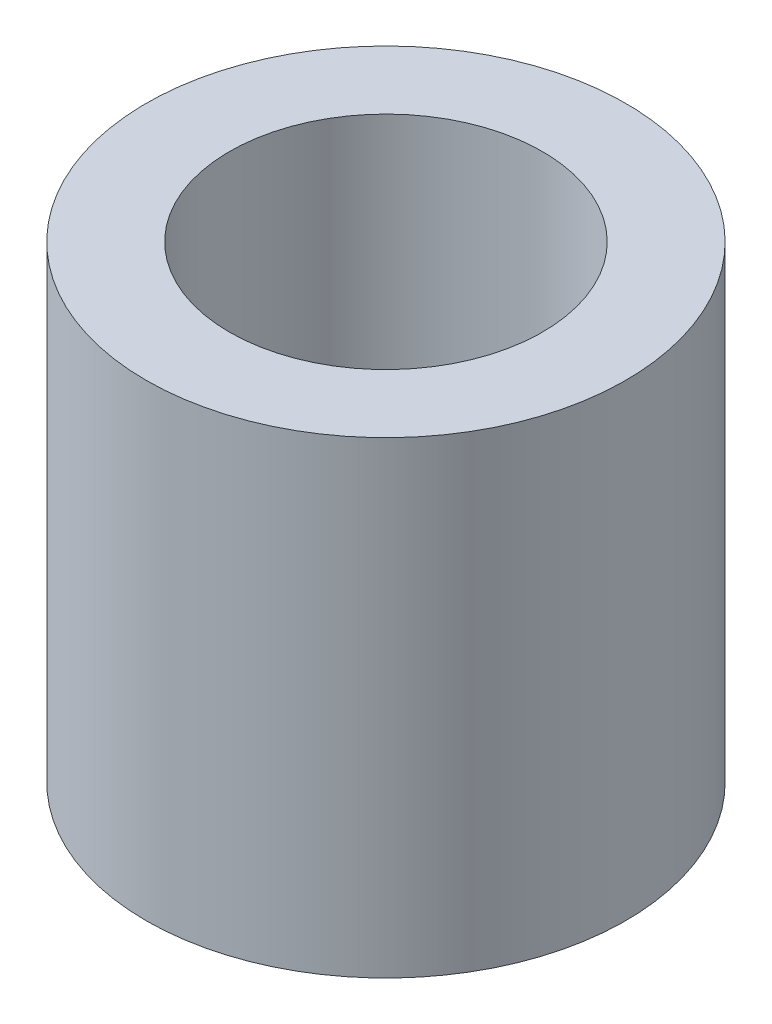
ISO-10303-21;
HEADER;
FILE_DESCRIPTION(('STEP AP214'),'2;1');
FILE_NAME('part.step','',(''),(''),'','','');
FILE_SCHEMA(('AUTOMOTIVE_DESIGN { 1 0 10303 214 1 1 1 1 }'));
ENDSEC;
DATA;
#1=APPLICATION_CONTEXT('core data for automotive mechanical design processes');
#2=APPLICATION_PROTOCOL_DEFINITION('international standard','automotive_design',2000,#1);
#3=PRODUCT_CONTEXT('',#1,'mechanical');
#4=PRODUCT('Part','Part','',(#3));
#5=PRODUCT_RELATED_PRODUCT_CATEGORY('part','',(#4));
#6=PRODUCT_DEFINITION_FORMATION('','',#4);
#7=PRODUCT_DEFINITION_CONTEXT('part definition',#1,'design');
#8=PRODUCT_DEFINITION('design','',#6,#7);
#9=PRODUCT_DEFINITION_SHAPE('','',#8);
#10=(LENGTH_UNIT() NAMED_UNIT(*) SI_UNIT(.MILLI.,.METRE.));
#11=(NAMED_UNIT(*) PLANE_ANGLE_UNIT() SI_UNIT($,.RADIAN.));
#12=(NAMED_UNIT(*) SI_UNIT($,.STERADIAN.) SOLID_ANGLE_UNIT());
#13=UNCERTAINTY_MEASURE_WITH_UNIT(LENGTH_MEASURE(1.E-05),#10,'distance_accuracy_value','');
#14=(GEOMETRIC_REPRESENTATION_CONTEXT(3) GLOBAL_UNCERTAINTY_ASSIGNED_CONTEXT((#13)) GLOBAL_UNIT_ASSIGNED_CONTEXT((#10,
#11,#12)) REPRESENTATION_CONTEXT('',''));
#15=CARTESIAN_POINT('',(0.,0.,0.));
#16=DIRECTION('',(0.,0.,1.));
#17=DIRECTION('',(1.,0.,0.));
#18=AXIS2_PLACEMENT_3D('',#15,#16,#17);
#19=CARTESIAN_POINT('',(0.,8.,0.));
#20=DIRECTION('',(0.,1.,0.));
#21=DIRECTION('',(0.,0.,1.));
#22=AXIS2_PLACEMENT_3D('',#19,#20,#21);
#23=PLANE('',#22);
#24=CARTESIAN_POINT('',(0.,8.,0.));
#25=DIRECTION('',(0.,1.,0.));
#26=DIRECTION('',(0.,0.,1.));
#27=AXIS2_PLACEMENT_3D('',#24,#25,#26);
#28=CIRCLE('',#27,4.1);
#29=CARTESIAN_POINT('',(0.,8.,4.1));
#30=VERTEX_POINT('',#29);
#31=EDGE_CURVE('E10',#30,#30,#28,.T.);
#32=ORIENTED_EDGE('',*,*,#31,.T.);
#33=EDGE_LOOP('',(#32));
#34=FACE_BOUND('',#33,.T.);
#35=CARTESIAN_POINT('',(0.,8.,0.));
#36=DIRECTION('',(0.,1.,0.));
#37=DIRECTION('',(0.,0.,1.));
#38=AXIS2_PLACEMENT_3D('',#35,#36,#37);
#39=CIRCLE('',#38,2.675);
#40=CARTESIAN_POINT('',(0.,8.,2.675));
#41=VERTEX_POINT('',#40);
#42=EDGE_CURVE('E50',#41,#41,#39,.T.);
#43=ORIENTED_EDGE('',*,*,#42,.F.);
#44=EDGE_LOOP('',(#43));
#45=FACE_BOUND('',#44,.T.);
#46=ADVANCED_FACE('F37',(#34,#45),#23,.T.);
#47=CARTESIAN_POINT('',(0.,0.,0.));
#48=DIRECTION('',(0.,1.,0.));
#49=DIRECTION('',(0.,0.,1.));
#50=AXIS2_PLACEMENT_3D('',#47,#48,#49);
#51=PLANE('',#50);
#52=CARTESIAN_POINT('',(0.,0.,0.));
#53=DIRECTION('',(0.,1.,0.));
#54=DIRECTION('',(0.,0.,1.));
#55=AXIS2_PLACEMENT_3D('',#52,#53,#54);
#56=CIRCLE('',#55,4.1);
#57=CARTESIAN_POINT('',(0.,0.,4.1));
#58=VERTEX_POINT('',#57);
#59=EDGE_CURVE('E41',#58,#58,#56,.T.);
#60=ORIENTED_EDGE('',*,*,#59,.F.);
#61=EDGE_LOOP('',(#60));
#62=FACE_BOUND('',#61,.T.);
#63=CARTESIAN_POINT('',(0.,0.,0.));
#64=DIRECTION('',(0.,1.,0.));
#65=DIRECTION('',(0.,0.,1.));
#66=AXIS2_PLACEMENT_3D('',#63,#64,#65);
#67=CIRCLE('',#66,2.675);
#68=CARTESIAN_POINT('',(0.,0.,2.675));
#69=VERTEX_POINT('',#68);
#70=EDGE_CURVE('E52',#69,#69,#67,.T.);
#71=ORIENTED_EDGE('',*,*,#70,.T.);
#72=EDGE_LOOP('',(#71));
#73=FACE_BOUND('',#72,.T.);
#74=ADVANCED_FACE('F64',(#62,#73),#51,.F.);
#75=CARTESIAN_POINT('',(0.,8.,0.));
#76=DIRECTION('',(0.,-1.,0.));
#77=DIRECTION('',(0.,0.,-1.));
#78=AXIS2_PLACEMENT_3D('',#75,#76,#77);
#79=CYLINDRICAL_SURFACE('',#78,4.1);
#80=ORIENTED_EDGE('',*,*,#31,.F.);
#81=EDGE_LOOP('',(#80));
#82=FACE_BOUND('',#81,.T.);
#83=ORIENTED_EDGE('',*,*,#59,.T.);
#84=EDGE_LOOP('',(#83));
#85=FACE_BOUND('',#84,.T.);
#86=ADVANCED_FACE('F39',(#82,#85),#79,.T.);
#87=CARTESIAN_POINT('',(0.,8.,0.));
#88=DIRECTION('',(0.,-1.,0.));
#89=DIRECTION('',(0.,0.,-1.));
#90=AXIS2_PLACEMENT_3D('',#87,#88,#89);
#91=CYLINDRICAL_SURFACE('',#90,2.675);
#92=ORIENTED_EDGE('',*,*,#42,.T.);
#93=EDGE_LOOP('',(#92));
#94=FACE_BOUND('',#93,.T.);
#95=ORIENTED_EDGE('',*,*,#70,.F.);
#96=EDGE_LOOP('',(#95));
#97=FACE_BOUND('',#96,.T.);
#98=ADVANCED_FACE('F60',(#94,#97),#91,.F.);
#99=CLOSED_SHELL('',(#46,#74,#86,#98));
#100=MANIFOLD_SOLID_BREP('B2',#99);
#101=ADVANCED_BREP_SHAPE_REPRESENTATION('',(#18,#100),#14);
#102=SHAPE_DEFINITION_REPRESENTATION(#9,#101);
ENDSEC;
END-ISO-10303-21;
